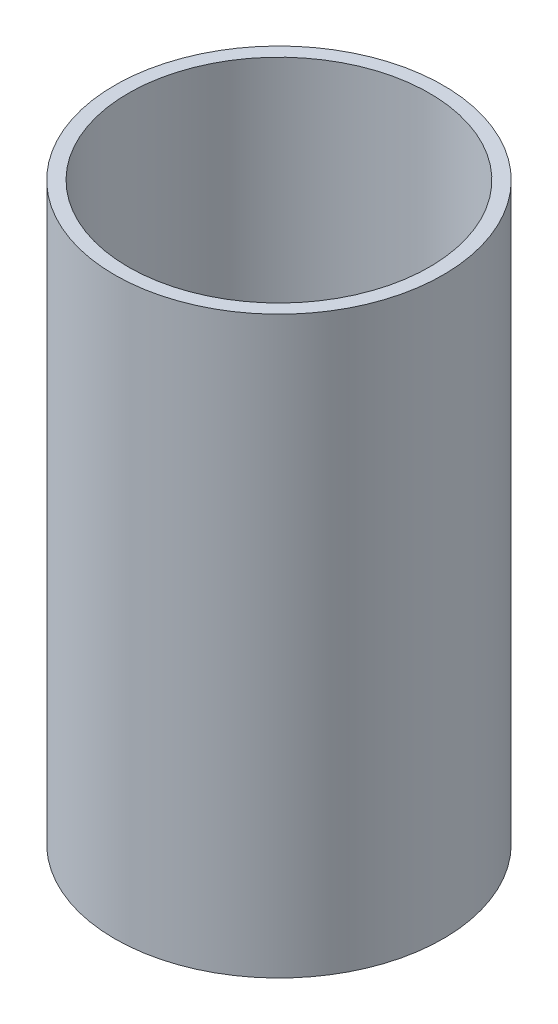
ISO-10303-21;
HEADER;
FILE_DESCRIPTION(('STEP AP214'),'2;1');
FILE_NAME('part.step','',(''),(''),'','','');
FILE_SCHEMA(('AUTOMOTIVE_DESIGN { 1 0 10303 214 1 1 1 1 }'));
ENDSEC;
DATA;
#1=APPLICATION_CONTEXT('core data for automotive mechanical design processes');
#2=APPLICATION_PROTOCOL_DEFINITION('international standard','automotive_design',2000,#1);
#3=PRODUCT_CONTEXT('',#1,'mechanical');
#4=PRODUCT('Part','Part','',(#3));
#5=PRODUCT_RELATED_PRODUCT_CATEGORY('part','',(#4));
#6=PRODUCT_DEFINITION_FORMATION('','',#4);
#7=PRODUCT_DEFINITION_CONTEXT('part definition',#1,'design');
#8=PRODUCT_DEFINITION('design','',#6,#7);
#9=PRODUCT_DEFINITION_SHAPE('','',#8);
#10=(LENGTH_UNIT() NAMED_UNIT(*) SI_UNIT(.MILLI.,.METRE.));
#11=(NAMED_UNIT(*) PLANE_ANGLE_UNIT() SI_UNIT($,.RADIAN.));
#12=(NAMED_UNIT(*) SI_UNIT($,.STERADIAN.) SOLID_ANGLE_UNIT());
#13=UNCERTAINTY_MEASURE_WITH_UNIT(LENGTH_MEASURE(1.E-05),#10,'distance_accuracy_value','');
#14=(GEOMETRIC_REPRESENTATION_CONTEXT(3) GLOBAL_UNCERTAINTY_ASSIGNED_CONTEXT((#13)) GLOBAL_UNIT_ASSIGNED_CONTEXT((#10,
#11,#12)) REPRESENTATION_CONTEXT('',''));
#15=CARTESIAN_POINT('',(0.,0.,0.));
#16=DIRECTION('',(0.,0.,1.));
#17=DIRECTION('',(1.,0.,0.));
#18=AXIS2_PLACEMENT_3D('',#15,#16,#17);
#19=CARTESIAN_POINT('',(0.,21.,0.));
#20=DIRECTION('',(0.,1.,0.));
#21=DIRECTION('',(0.,0.,1.));
#22=AXIS2_PLACEMENT_3D('',#19,#20,#21);
#23=PLANE('',#22);
#24=CARTESIAN_POINT('',(0.,21.,0.));
#25=DIRECTION('',(0.,1.,0.));
#26=DIRECTION('',(0.,0.,1.));
#27=AXIS2_PLACEMENT_3D('',#24,#25,#26);
#28=CIRCLE('',#27,12.);
#29=CARTESIAN_POINT('',(0.,21.,12.));
#30=VERTEX_POINT('',#29);
#31=EDGE_CURVE('E10',#30,#30,#28,.T.);
#32=ORIENTED_EDGE('',*,*,#31,.T.);
#33=EDGE_LOOP('',(#32));
#34=FACE_BOUND('',#33,.T.);
#35=CARTESIAN_POINT('',(0.,21.,0.));
#36=DIRECTION('',(0.,1.,0.));
#37=DIRECTION('',(0.,0.,1.));
#38=AXIS2_PLACEMENT_3D('',#35,#36,#37);
#39=CIRCLE('',#38,11.);
#40=CARTESIAN_POINT('',(0.,21.,11.));
#41=VERTEX_POINT('',#40);
#42=EDGE_CURVE('E44',#41,#41,#39,.T.);
#43=ORIENTED_EDGE('',*,*,#42,.F.);
#44=EDGE_LOOP('',(#43));
#45=FACE_BOUND('',#44,.T.);
#46=ADVANCED_FACE('F33',(#34,#45),#23,.T.);
#47=CARTESIAN_POINT('',(0.,-21.,0.));
#48=DIRECTION('',(0.,1.,0.));
#49=DIRECTION('',(0.,0.,1.));
#50=AXIS2_PLACEMENT_3D('',#47,#48,#49);
#51=PLANE('',#50);
#52=CARTESIAN_POINT('',(0.,-21.,0.));
#53=DIRECTION('',(0.,1.,0.));
#54=DIRECTION('',(0.,0.,1.));
#55=AXIS2_PLACEMENT_3D('',#52,#53,#54);
#56=CIRCLE('',#55,12.);
#57=CARTESIAN_POINT('',(0.,-21.,12.));
#58=VERTEX_POINT('',#57);
#59=EDGE_CURVE('E37',#58,#58,#56,.T.);
#60=ORIENTED_EDGE('',*,*,#59,.F.);
#61=EDGE_LOOP('',(#60));
#62=FACE_BOUND('',#61,.T.);
#63=CARTESIAN_POINT('',(0.,-21.,0.));
#64=DIRECTION('',(0.,1.,0.));
#65=DIRECTION('',(0.,0.,1.));
#66=AXIS2_PLACEMENT_3D('',#63,#64,#65);
#67=CIRCLE('',#66,11.);
#68=CARTESIAN_POINT('',(0.,-21.,11.));
#69=VERTEX_POINT('',#68);
#70=EDGE_CURVE('E46',#69,#69,#67,.T.);
#71=ORIENTED_EDGE('',*,*,#70,.T.);
#72=EDGE_LOOP('',(#71));
#73=FACE_BOUND('',#72,.T.);
#74=ADVANCED_FACE('F56',(#62,#73),#51,.F.);
#75=CARTESIAN_POINT('',(0.,21.,0.));
#76=DIRECTION('',(0.,-1.,0.));
#77=DIRECTION('',(0.,0.,-1.));
#78=AXIS2_PLACEMENT_3D('',#75,#76,#77);
#79=CYLINDRICAL_SURFACE('',#78,12.);
#80=ORIENTED_EDGE('',*,*,#31,.F.);
#81=EDGE_LOOP('',(#80));
#82=FACE_BOUND('',#81,.T.);
#83=ORIENTED_EDGE('',*,*,#59,.T.);
#84=EDGE_LOOP('',(#83));
#85=FACE_BOUND('',#84,.T.);
#86=ADVANCED_FACE('F35',(#82,#85),#79,.T.);
#87=CARTESIAN_POINT('',(0.,21.,0.));
#88=DIRECTION('',(0.,-1.,0.));
#89=DIRECTION('',(0.,0.,-1.));
#90=AXIS2_PLACEMENT_3D('',#87,#88,#89);
#91=CYLINDRICAL_SURFACE('',#90,11.);
#92=ORIENTED_EDGE('',*,*,#42,.T.);
#93=EDGE_LOOP('',(#92));
#94=FACE_BOUND('',#93,.T.);
#95=ORIENTED_EDGE('',*,*,#70,.F.);
#96=EDGE_LOOP('',(#95));
#97=FACE_BOUND('',#96,.T.);
#98=ADVANCED_FACE('F52',(#94,#97),#91,.F.);
#99=CLOSED_SHELL('',(#46,#74,#86,#98));
#100=MANIFOLD_SOLID_BREP('B2',#99);
#101=ADVANCED_BREP_SHAPE_REPRESENTATION('',(#18,#100),#14);
#102=SHAPE_DEFINITION_REPRESENTATION(#9,#101);
ENDSEC;
END-ISO-10303-21;
